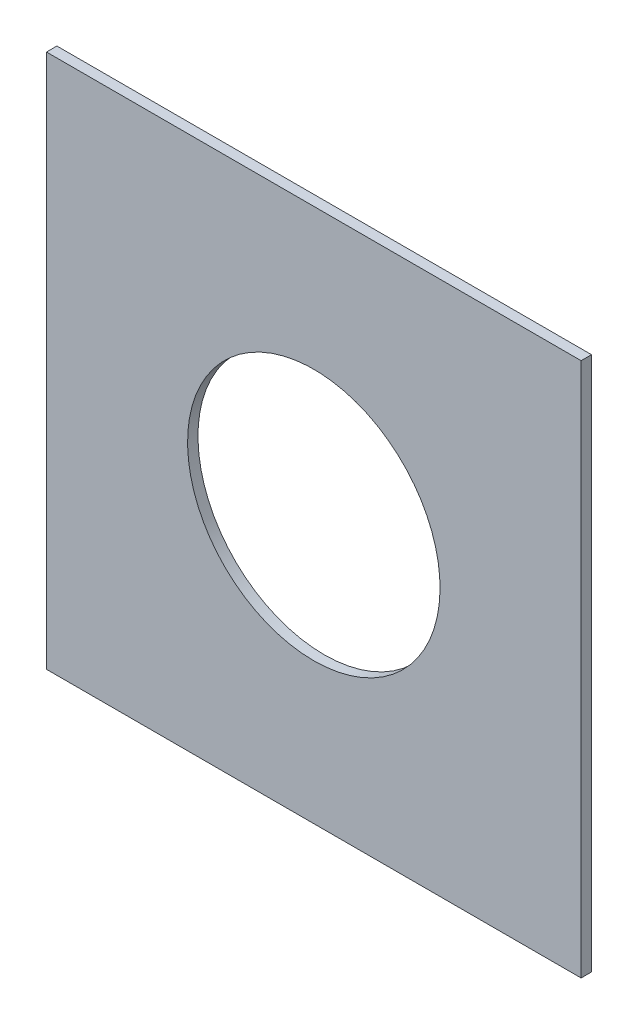
ISO-10303-21;
HEADER;
FILE_DESCRIPTION(('STEP AP214'),'2;1');
FILE_NAME('part.step','',(''),(''),'','','');
FILE_SCHEMA(('AUTOMOTIVE_DESIGN { 1 0 10303 214 1 1 1 1 }'));
ENDSEC;
DATA;
#1=APPLICATION_CONTEXT('core data for automotive mechanical design processes');
#2=APPLICATION_PROTOCOL_DEFINITION('international standard','automotive_design',2000,#1);
#3=PRODUCT_CONTEXT('',#1,'mechanical');
#4=PRODUCT('Part','Part','',(#3));
#5=PRODUCT_RELATED_PRODUCT_CATEGORY('part','',(#4));
#6=PRODUCT_DEFINITION_FORMATION('','',#4);
#7=PRODUCT_DEFINITION_CONTEXT('part definition',#1,'design');
#8=PRODUCT_DEFINITION('design','',#6,#7);
#9=PRODUCT_DEFINITION_SHAPE('','',#8);
#10=(LENGTH_UNIT() NAMED_UNIT(*) SI_UNIT(.MILLI.,.METRE.));
#11=(NAMED_UNIT(*) PLANE_ANGLE_UNIT() SI_UNIT($,.RADIAN.));
#12=(NAMED_UNIT(*) SI_UNIT($,.STERADIAN.) SOLID_ANGLE_UNIT());
#13=UNCERTAINTY_MEASURE_WITH_UNIT(LENGTH_MEASURE(1.E-05),#10,'distance_accuracy_value','');
#14=(GEOMETRIC_REPRESENTATION_CONTEXT(3) GLOBAL_UNCERTAINTY_ASSIGNED_CONTEXT((#13)) GLOBAL_UNIT_ASSIGNED_CONTEXT((#10,
#11,#12)) REPRESENTATION_CONTEXT('',''));
#15=CARTESIAN_POINT('',(0.,0.,0.));
#16=DIRECTION('',(0.,0.,1.));
#17=DIRECTION('',(1.,0.,0.));
#18=AXIS2_PLACEMENT_3D('',#15,#16,#17);
#19=CARTESIAN_POINT('',(172.8978,-71.2108,-0.045));
#20=DIRECTION('',(0.,0.,-1.));
#21=DIRECTION('',(0.,-1.,0.));
#22=AXIS2_PLACEMENT_3D('',#19,#20,#21);
#23=CYLINDRICAL_SURFACE('',#22,0.425);
#24=CARTESIAN_POINT('',(172.8978,-71.2108,-0.035));
#25=DIRECTION('',(0.,0.,-1.));
#26=DIRECTION('',(0.,-1.,0.));
#27=AXIS2_PLACEMENT_3D('',#24,#25,#26);
#28=CIRCLE('',#27,0.425);
#29=CARTESIAN_POINT('',(172.8978,-71.6358,-0.035));
#30=VERTEX_POINT('',#29);
#31=EDGE_CURVE('E128',#30,#30,#28,.T.);
#32=ORIENTED_EDGE('',*,*,#31,.T.);
#33=DIRECTION('',(0.,0.,1.));
#34=VECTOR('',#33,1.);
#35=CARTESIAN_POINT('',(172.8978,-71.6358,-0.045));
#36=LINE('',#35,#34);
#37=CARTESIAN_POINT('',(172.8978,-71.6358,0.));
#38=VERTEX_POINT('',#37);
#39=EDGE_CURVE('E11',#30,#38,#36,.T.);
#40=ORIENTED_EDGE('',*,*,#39,.T.);
#41=CARTESIAN_POINT('',(172.8978,-71.2108,0.));
#42=DIRECTION('',(0.,0.,-1.));
#43=DIRECTION('',(0.,-1.,0.));
#44=AXIS2_PLACEMENT_3D('',#41,#42,#43);
#45=CIRCLE('',#44,0.425);
#46=EDGE_CURVE('E25',#38,#38,#45,.T.);
#47=ORIENTED_EDGE('',*,*,#46,.F.);
#48=ORIENTED_EDGE('',*,*,#39,.F.);
#49=EDGE_LOOP('',(#32,#40,#47,#48));
#50=FACE_BOUND('',#49,.T.);
#51=ADVANCED_FACE('F17',(#50),#23,.F.);
#52=CARTESIAN_POINT('',(171.9978,-70.3108,-0.035));
#53=DIRECTION('',(0.,1.,0.));
#54=DIRECTION('',(1.,0.,0.));
#55=AXIS2_PLACEMENT_3D('',#52,#53,#54);
#56=PLANE('',#55);
#57=DIRECTION('',(0.,0.,1.));
#58=VECTOR('',#57,1.);
#59=CARTESIAN_POINT('',(171.9978,-70.3108,-0.035));
#60=LINE('',#59,#58);
#61=CARTESIAN_POINT('',(171.9978,-70.3108,-0.035));
#62=VERTEX_POINT('',#61);
#63=CARTESIAN_POINT('',(171.9978,-70.3108,0.));
#64=VERTEX_POINT('',#63);
#65=EDGE_CURVE('E119',#62,#64,#60,.T.);
#66=ORIENTED_EDGE('',*,*,#65,.T.);
#67=DIRECTION('',(1.,0.,0.));
#68=VECTOR('',#67,1.);
#69=CARTESIAN_POINT('',(171.9978,-70.3108,0.));
#70=LINE('',#69,#68);
#71=CARTESIAN_POINT('',(173.7978,-70.3108,0.));
#72=VERTEX_POINT('',#71);
#73=EDGE_CURVE('E115',#64,#72,#70,.T.);
#74=ORIENTED_EDGE('',*,*,#73,.T.);
#75=DIRECTION('',(0.,0.,1.));
#76=VECTOR('',#75,1.);
#77=CARTESIAN_POINT('',(173.7978,-70.3108,-0.035));
#78=LINE('',#77,#76);
#79=CARTESIAN_POINT('',(173.7978,-70.3108,-0.035));
#80=VERTEX_POINT('',#79);
#81=EDGE_CURVE('E98',#80,#72,#78,.T.);
#82=ORIENTED_EDGE('',*,*,#81,.F.);
#83=DIRECTION('',(1.,0.,0.));
#84=VECTOR('',#83,1.);
#85=CARTESIAN_POINT('',(171.9978,-70.3108,-0.035));
#86=LINE('',#85,#84);
#87=EDGE_CURVE('E81',#62,#80,#86,.T.);
#88=ORIENTED_EDGE('',*,*,#87,.F.);
#89=EDGE_LOOP('',(#66,#74,#82,#88));
#90=FACE_BOUND('',#89,.T.);
#91=ADVANCED_FACE('F134',(#90),#56,.T.);
#92=CARTESIAN_POINT('',(0.,0.,0.));
#93=DIRECTION('',(0.,0.,1.));
#94=DIRECTION('',(1.,0.,0.));
#95=AXIS2_PLACEMENT_3D('',#92,#93,#94);
#96=PLANE('',#95);
#97=ORIENTED_EDGE('',*,*,#46,.T.);
#98=EDGE_LOOP('',(#97));
#99=FACE_BOUND('',#98,.T.);
#100=DIRECTION('',(-1.,0.,0.));
#101=VECTOR('',#100,1.);
#102=CARTESIAN_POINT('',(173.7978,-72.1108,0.));
#103=LINE('',#102,#101);
#104=CARTESIAN_POINT('',(173.7978,-72.1108,0.));
#105=VERTEX_POINT('',#104);
#106=CARTESIAN_POINT('',(171.9978,-72.1108,0.));
#107=VERTEX_POINT('',#106);
#108=EDGE_CURVE('E104',#105,#107,#103,.T.);
#109=ORIENTED_EDGE('',*,*,#108,.F.);
#110=DIRECTION('',(0.,-1.,0.));
#111=VECTOR('',#110,1.);
#112=CARTESIAN_POINT('',(173.7978,-70.3108,0.));
#113=LINE('',#112,#111);
#114=EDGE_CURVE('E88',#72,#105,#113,.T.);
#115=ORIENTED_EDGE('',*,*,#114,.F.);
#116=ORIENTED_EDGE('',*,*,#73,.F.);
#117=DIRECTION('',(0.,1.,0.));
#118=VECTOR('',#117,1.);
#119=CARTESIAN_POINT('',(171.9978,-72.1108,0.));
#120=LINE('',#119,#118);
#121=EDGE_CURVE('E87',#107,#64,#120,.T.);
#122=ORIENTED_EDGE('',*,*,#121,.F.);
#123=EDGE_LOOP('',(#109,#115,#116,#122));
#124=FACE_BOUND('',#123,.T.);
#125=ADVANCED_FACE('F138',(#99,#124),#96,.T.);
#126=CARTESIAN_POINT('',(0.,0.,-0.035));
#127=DIRECTION('',(0.,0.,1.));
#128=DIRECTION('',(1.,0.,0.));
#129=AXIS2_PLACEMENT_3D('',#126,#127,#128);
#130=PLANE('',#129);
#131=ORIENTED_EDGE('',*,*,#31,.F.);
#132=EDGE_LOOP('',(#131));
#133=FACE_BOUND('',#132,.T.);
#134=DIRECTION('',(0.,1.,0.));
#135=VECTOR('',#134,1.);
#136=CARTESIAN_POINT('',(171.9978,-72.1108,-0.035));
#137=LINE('',#136,#135);
#138=CARTESIAN_POINT('',(171.9978,-72.1108,-0.035));
#139=VERTEX_POINT('',#138);
#140=EDGE_CURVE('E123',#139,#62,#137,.T.);
#141=ORIENTED_EDGE('',*,*,#140,.T.);
#142=ORIENTED_EDGE('',*,*,#87,.T.);
#143=DIRECTION('',(0.,-1.,0.));
#144=VECTOR('',#143,1.);
#145=CARTESIAN_POINT('',(173.7978,-70.3108,-0.035));
#146=LINE('',#145,#144);
#147=CARTESIAN_POINT('',(173.7978,-72.1108,-0.035));
#148=VERTEX_POINT('',#147);
#149=EDGE_CURVE('E75',#80,#148,#146,.T.);
#150=ORIENTED_EDGE('',*,*,#149,.T.);
#151=DIRECTION('',(-1.,0.,0.));
#152=VECTOR('',#151,1.);
#153=CARTESIAN_POINT('',(173.7978,-72.1108,-0.035));
#154=LINE('',#153,#152);
#155=EDGE_CURVE('E79',#148,#139,#154,.T.);
#156=ORIENTED_EDGE('',*,*,#155,.T.);
#157=EDGE_LOOP('',(#141,#142,#150,#156));
#158=FACE_BOUND('',#157,.T.);
#159=ADVANCED_FACE('F78',(#133,#158),#130,.F.);
#160=CARTESIAN_POINT('',(171.9978,-72.1108,-0.035));
#161=DIRECTION('',(-1.,0.,0.));
#162=DIRECTION('',(0.,0.,1.));
#163=AXIS2_PLACEMENT_3D('',#160,#161,#162);
#164=PLANE('',#163);
#165=DIRECTION('',(0.,0.,1.));
#166=VECTOR('',#165,1.);
#167=CARTESIAN_POINT('',(171.9978,-72.1108,-0.035));
#168=LINE('',#167,#166);
#169=EDGE_CURVE('E96',#139,#107,#168,.T.);
#170=ORIENTED_EDGE('',*,*,#169,.T.);
#171=ORIENTED_EDGE('',*,*,#121,.T.);
#172=ORIENTED_EDGE('',*,*,#65,.F.);
#173=ORIENTED_EDGE('',*,*,#140,.F.);
#174=EDGE_LOOP('',(#170,#171,#172,#173));
#175=FACE_BOUND('',#174,.T.);
#176=ADVANCED_FACE('F186',(#175),#164,.T.);
#177=CARTESIAN_POINT('',(173.7978,-70.3108,-0.035));
#178=DIRECTION('',(1.,0.,0.));
#179=DIRECTION('',(0.,1.,0.));
#180=AXIS2_PLACEMENT_3D('',#177,#178,#179);
#181=PLANE('',#180);
#182=ORIENTED_EDGE('',*,*,#81,.T.);
#183=ORIENTED_EDGE('',*,*,#114,.T.);
#184=DIRECTION('',(0.,0.,1.));
#185=VECTOR('',#184,1.);
#186=CARTESIAN_POINT('',(173.7978,-72.1108,-0.035));
#187=LINE('',#186,#185);
#188=EDGE_CURVE('E94',#148,#105,#187,.T.);
#189=ORIENTED_EDGE('',*,*,#188,.F.);
#190=ORIENTED_EDGE('',*,*,#149,.F.);
#191=EDGE_LOOP('',(#182,#183,#189,#190));
#192=FACE_BOUND('',#191,.T.);
#193=ADVANCED_FACE('F100',(#192),#181,.T.);
#194=CARTESIAN_POINT('',(173.7978,-72.1108,-0.035));
#195=DIRECTION('',(0.,-1.,0.));
#196=DIRECTION('',(0.,0.,-1.));
#197=AXIS2_PLACEMENT_3D('',#194,#195,#196);
#198=PLANE('',#197);
#199=ORIENTED_EDGE('',*,*,#188,.T.);
#200=ORIENTED_EDGE('',*,*,#108,.T.);
#201=ORIENTED_EDGE('',*,*,#169,.F.);
#202=ORIENTED_EDGE('',*,*,#155,.F.);
#203=EDGE_LOOP('',(#199,#200,#201,#202));
#204=FACE_BOUND('',#203,.T.);
#205=ADVANCED_FACE('F92',(#204),#198,.T.);
#206=CLOSED_SHELL('',(#51,#91,#125,#159,#176,#193,#205));
#207=MANIFOLD_SOLID_BREP('B1',#206);
#208=ADVANCED_BREP_SHAPE_REPRESENTATION('',(#18,#207),#14);
#209=SHAPE_DEFINITION_REPRESENTATION(#9,#208);
ENDSEC;
END-ISO-10303-21;
